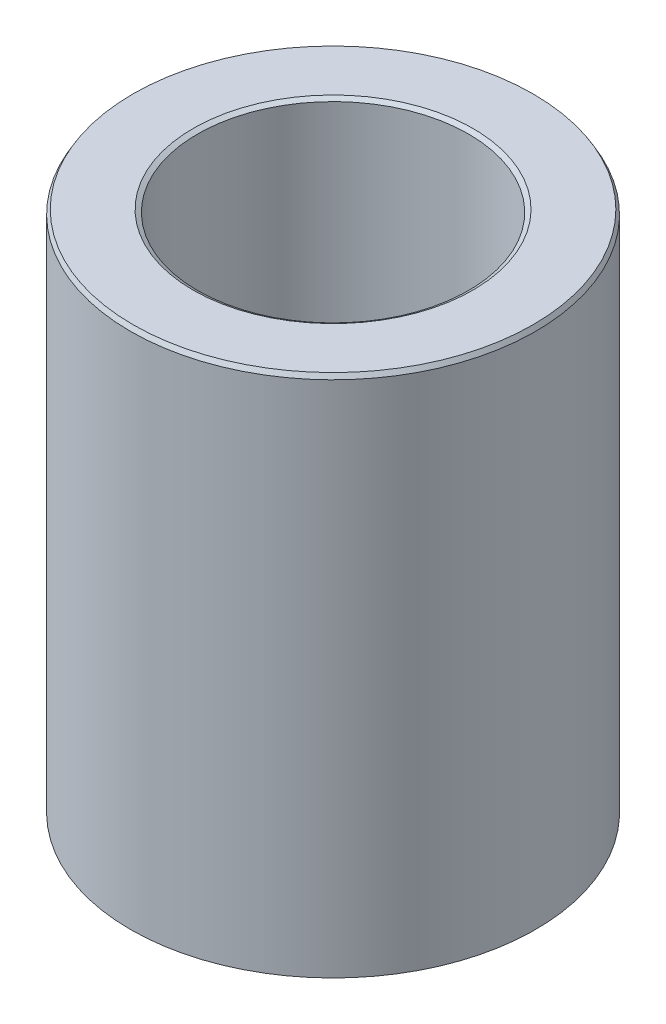
ISO-10303-21;
HEADER;
FILE_DESCRIPTION(('STEP AP214'),'2;1');
FILE_NAME('part.step','',(''),(''),'','','');
FILE_SCHEMA(('AUTOMOTIVE_DESIGN { 1 0 10303 214 1 1 1 1 }'));
ENDSEC;
DATA;
#1=APPLICATION_CONTEXT('core data for automotive mechanical design processes');
#2=APPLICATION_PROTOCOL_DEFINITION('international standard','automotive_design',2000,#1);
#3=PRODUCT_CONTEXT('',#1,'mechanical');
#4=PRODUCT('Part','Part','',(#3));
#5=PRODUCT_RELATED_PRODUCT_CATEGORY('part','',(#4));
#6=PRODUCT_DEFINITION_FORMATION('','',#4);
#7=PRODUCT_DEFINITION_CONTEXT('part definition',#1,'design');
#8=PRODUCT_DEFINITION('design','',#6,#7);
#9=PRODUCT_DEFINITION_SHAPE('','',#8);
#10=(LENGTH_UNIT() NAMED_UNIT(*) SI_UNIT(.MILLI.,.METRE.));
#11=(NAMED_UNIT(*) PLANE_ANGLE_UNIT() SI_UNIT($,.RADIAN.));
#12=(NAMED_UNIT(*) SI_UNIT($,.STERADIAN.) SOLID_ANGLE_UNIT());
#13=UNCERTAINTY_MEASURE_WITH_UNIT(LENGTH_MEASURE(1.E-05),#10,'distance_accuracy_value','');
#14=(GEOMETRIC_REPRESENTATION_CONTEXT(3) GLOBAL_UNCERTAINTY_ASSIGNED_CONTEXT((#13)) GLOBAL_UNIT_ASSIGNED_CONTEXT((#10,
#11,#12)) REPRESENTATION_CONTEXT('',''));
#15=CARTESIAN_POINT('',(0.,0.,0.));
#16=DIRECTION('',(0.,0.,1.));
#17=DIRECTION('',(1.,0.,0.));
#18=AXIS2_PLACEMENT_3D('',#15,#16,#17);
#19=CARTESIAN_POINT('',(0.,103.689007671274,0.));
#20=DIRECTION('',(0.,-1.,0.));
#21=DIRECTION('',(0.,0.,-1.));
#22=AXIS2_PLACEMENT_3D('',#19,#20,#21);
#23=CYLINDRICAL_SURFACE('',#22,40.);
#24=CARTESIAN_POINT('',(0.,0.508016925487811,0.));
#25=DIRECTION('',(0.,1.,0.));
#26=DIRECTION('',(0.,0.,1.));
#27=AXIS2_PLACEMENT_3D('',#24,#25,#26);
#28=CIRCLE('',#27,40.);
#29=CARTESIAN_POINT('',(0.,0.508016925487811,40.));
#30=VERTEX_POINT('',#29);
#31=EDGE_CURVE('E10',#30,#30,#28,.T.);
#32=ORIENTED_EDGE('',*,*,#31,.T.);
#33=EDGE_LOOP('',(#32));
#34=FACE_BOUND('',#33,.T.);
#35=CARTESIAN_POINT('',(0.,102.809096545225,0.));
#36=DIRECTION('',(0.,1.,0.));
#37=DIRECTION('',(0.,0.,1.));
#38=AXIS2_PLACEMENT_3D('',#35,#36,#37);
#39=CIRCLE('',#38,40.);
#40=CARTESIAN_POINT('',(0.,102.809096545225,40.));
#41=VERTEX_POINT('',#40);
#42=EDGE_CURVE('E50',#41,#41,#39,.F.);
#43=ORIENTED_EDGE('',*,*,#42,.T.);
#44=EDGE_LOOP('',(#43));
#45=FACE_BOUND('',#44,.T.);
#46=ADVANCED_FACE('F39',(#34,#45),#23,.T.);
#47=CARTESIAN_POINT('',(0.,103.689007671274,0.));
#48=DIRECTION('',(0.,1.,0.));
#49=DIRECTION('',(0.,0.,1.));
#50=AXIS2_PLACEMENT_3D('',#47,#48,#49);
#51=PLANE('',#50);
#52=CARTESIAN_POINT('',(0.,103.689007671274,0.));
#53=DIRECTION('',(0.,1.,0.));
#54=DIRECTION('',(0.,0.,1.));
#55=AXIS2_PLACEMENT_3D('',#52,#53,#54);
#56=CIRCLE('',#55,27.6467789998823);
#57=CARTESIAN_POINT('',(0.,103.689007671274,27.6467789998823));
#58=VERTEX_POINT('',#57);
#59=EDGE_CURVE('E58',#58,#58,#56,.F.);
#60=ORIENTED_EDGE('',*,*,#59,.T.);
#61=EDGE_LOOP('',(#60));
#62=FACE_BOUND('',#61,.T.);
#63=CARTESIAN_POINT('',(0.,103.689007671274,0.));
#64=DIRECTION('',(0.,1.,0.));
#65=DIRECTION('',(0.,0.,1.));
#66=AXIS2_PLACEMENT_3D('',#63,#64,#65);
#67=CIRCLE('',#66,39.4919830745122);
#68=CARTESIAN_POINT('',(0.,103.689007671274,39.4919830745122));
#69=VERTEX_POINT('',#68);
#70=EDGE_CURVE('E61',#69,#69,#67,.T.);
#71=ORIENTED_EDGE('',*,*,#70,.T.);
#72=EDGE_LOOP('',(#71));
#73=FACE_BOUND('',#72,.T.);
#74=ADVANCED_FACE('F88',(#62,#73),#51,.T.);
#75=CARTESIAN_POINT('',(0.,0.,0.));
#76=DIRECTION('',(0.,1.,0.));
#77=DIRECTION('',(0.,0.,1.));
#78=AXIS2_PLACEMENT_3D('',#75,#76,#77);
#79=PLANE('',#78);
#80=CARTESIAN_POINT('',(0.,0.,0.));
#81=DIRECTION('',(0.,1.,0.));
#82=DIRECTION('',(0.,0.,1.));
#83=AXIS2_PLACEMENT_3D('',#80,#81,#82);
#84=CIRCLE('',#83,27.2748847993202);
#85=CARTESIAN_POINT('',(0.,0.,27.2748847993202));
#86=VERTEX_POINT('',#85);
#87=EDGE_CURVE('E51',#86,#86,#84,.T.);
#88=ORIENTED_EDGE('',*,*,#87,.T.);
#89=EDGE_LOOP('',(#88));
#90=FACE_BOUND('',#89,.T.);
#91=CARTESIAN_POINT('',(0.,0.,0.));
#92=DIRECTION('',(0.,1.,0.));
#93=DIRECTION('',(0.,0.,1.));
#94=AXIS2_PLACEMENT_3D('',#91,#92,#93);
#95=CIRCLE('',#94,39.1200888739502);
#96=CARTESIAN_POINT('',(0.,0.,39.1200888739502));
#97=VERTEX_POINT('',#96);
#98=EDGE_CURVE('E54',#97,#97,#95,.F.);
#99=ORIENTED_EDGE('',*,*,#98,.T.);
#100=EDGE_LOOP('',(#99));
#101=FACE_BOUND('',#100,.T.);
#102=ADVANCED_FACE('F83',(#90,#101),#79,.F.);
#103=CARTESIAN_POINT('',(0.,103.689007671274,0.));
#104=DIRECTION('',(0.,-1.,0.));
#105=DIRECTION('',(0.,0.,-1.));
#106=AXIS2_PLACEMENT_3D('',#103,#104,#105);
#107=CYLINDRICAL_SURFACE('',#106,26.7668678738324);
#108=CARTESIAN_POINT('',(0.,103.180990745787,0.));
#109=DIRECTION('',(0.,1.,0.));
#110=DIRECTION('',(0.,0.,1.));
#111=AXIS2_PLACEMENT_3D('',#108,#109,#110);
#112=CIRCLE('',#111,26.7668678738324);
#113=CARTESIAN_POINT('',(0.,103.180990745787,26.7668678738324));
#114=VERTEX_POINT('',#113);
#115=EDGE_CURVE('E67',#114,#114,#112,.T.);
#116=ORIENTED_EDGE('',*,*,#115,.T.);
#117=EDGE_LOOP('',(#116));
#118=FACE_BOUND('',#117,.T.);
#119=CARTESIAN_POINT('',(0.,0.879911126049834,0.));
#120=DIRECTION('',(0.,1.,0.));
#121=DIRECTION('',(0.,0.,1.));
#122=AXIS2_PLACEMENT_3D('',#119,#120,#121);
#123=CIRCLE('',#122,26.7668678738324);
#124=CARTESIAN_POINT('',(0.,0.879911126049834,26.7668678738324));
#125=VERTEX_POINT('',#124);
#126=EDGE_CURVE('E69',#125,#125,#123,.F.);
#127=ORIENTED_EDGE('',*,*,#126,.T.);
#128=EDGE_LOOP('',(#127));
#129=FACE_BOUND('',#128,.T.);
#130=ADVANCED_FACE('F71',(#118,#129),#107,.F.);
#131=CARTESIAN_POINT('',(0.,103.180990745787,0.));
#132=DIRECTION('',(0.,1.,0.));
#133=DIRECTION('',(0.,0.,1.));
#134=AXIS2_PLACEMENT_3D('',#131,#132,#133);
#135=CONICAL_SURFACE('',#134,26.7668678738324,1.0471975511966);
#136=ORIENTED_EDGE('',*,*,#59,.F.);
#137=EDGE_LOOP('',(#136));
#138=FACE_BOUND('',#137,.T.);
#139=ORIENTED_EDGE('',*,*,#115,.F.);
#140=EDGE_LOOP('',(#139));
#141=FACE_BOUND('',#140,.T.);
#142=ADVANCED_FACE('F77',(#138,#141),#135,.F.);
#143=CARTESIAN_POINT('',(0.,0.,0.));
#144=DIRECTION('',(0.,-1.,0.));
#145=DIRECTION('',(0.,0.,-1.));
#146=AXIS2_PLACEMENT_3D('',#143,#144,#145);
#147=CONICAL_SURFACE('',#146,27.2748847993202,0.523598775598293);
#148=ORIENTED_EDGE('',*,*,#126,.F.);
#149=EDGE_LOOP('',(#148));
#150=FACE_BOUND('',#149,.T.);
#151=ORIENTED_EDGE('',*,*,#87,.F.);
#152=EDGE_LOOP('',(#151));
#153=FACE_BOUND('',#152,.T.);
#154=ADVANCED_FACE('F73',(#150,#153),#147,.F.);
#155=CARTESIAN_POINT('',(0.,0.508016925487811,0.));
#156=DIRECTION('',(0.,1.,0.));
#157=DIRECTION('',(0.,0.,1.));
#158=AXIS2_PLACEMENT_3D('',#155,#156,#157);
#159=CONICAL_SURFACE('',#158,40.,1.0471975511966);
#160=ORIENTED_EDGE('',*,*,#98,.F.);
#161=EDGE_LOOP('',(#160));
#162=FACE_BOUND('',#161,.T.);
#163=ORIENTED_EDGE('',*,*,#31,.F.);
#164=EDGE_LOOP('',(#163));
#165=FACE_BOUND('',#164,.T.);
#166=ADVANCED_FACE('F76',(#162,#165),#159,.T.);
#167=CARTESIAN_POINT('',(0.,103.689007671274,0.));
#168=DIRECTION('',(0.,-1.,0.));
#169=DIRECTION('',(0.,0.,-1.));
#170=AXIS2_PLACEMENT_3D('',#167,#168,#169);
#171=CONICAL_SURFACE('',#170,39.4919830745122,0.523598775598299);
#172=ORIENTED_EDGE('',*,*,#42,.F.);
#173=EDGE_LOOP('',(#172));
#174=FACE_BOUND('',#173,.T.);
#175=ORIENTED_EDGE('',*,*,#70,.F.);
#176=EDGE_LOOP('',(#175));
#177=FACE_BOUND('',#176,.T.);
#178=ADVANCED_FACE('F45',(#174,#177),#171,.T.);
#179=CLOSED_SHELL('',(#46,#74,#102,#130,#142,#154,#166,#178));
#180=MANIFOLD_SOLID_BREP('B2',#179);
#181=ADVANCED_BREP_SHAPE_REPRESENTATION('',(#18,#180),#14);
#182=SHAPE_DEFINITION_REPRESENTATION(#9,#181);
ENDSEC;
END-ISO-10303-21;
